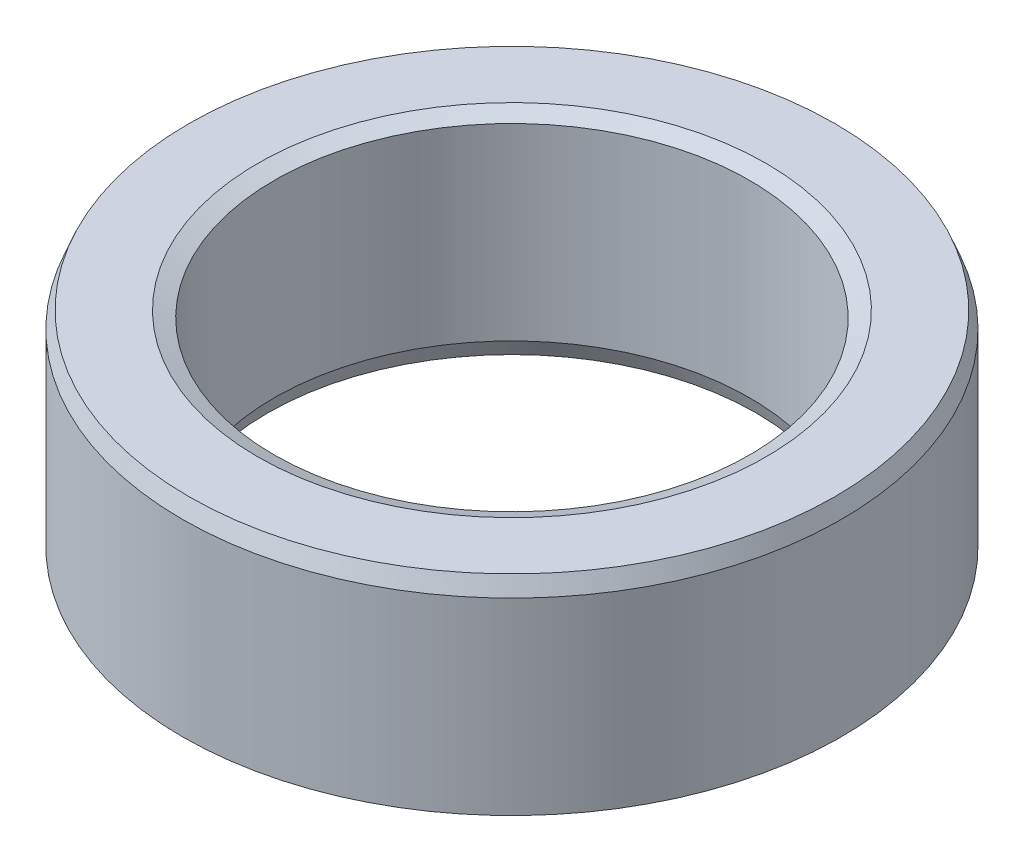
ISO-10303-21;
HEADER;
FILE_DESCRIPTION(('STEP AP214'),'2;1');
FILE_NAME('part.step','',(''),(''),'','','');
FILE_SCHEMA(('AUTOMOTIVE_DESIGN { 1 0 10303 214 1 1 1 1 }'));
ENDSEC;
DATA;
#1=APPLICATION_CONTEXT('core data for automotive mechanical design processes');
#2=APPLICATION_PROTOCOL_DEFINITION('international standard','automotive_design',2000,#1);
#3=PRODUCT_CONTEXT('',#1,'mechanical');
#4=PRODUCT('Part','Part','',(#3));
#5=PRODUCT_RELATED_PRODUCT_CATEGORY('part','',(#4));
#6=PRODUCT_DEFINITION_FORMATION('','',#4);
#7=PRODUCT_DEFINITION_CONTEXT('part definition',#1,'design');
#8=PRODUCT_DEFINITION('design','',#6,#7);
#9=PRODUCT_DEFINITION_SHAPE('','',#8);
#10=(LENGTH_UNIT() NAMED_UNIT(*) SI_UNIT(.MILLI.,.METRE.));
#11=(NAMED_UNIT(*) PLANE_ANGLE_UNIT() SI_UNIT($,.RADIAN.));
#12=(NAMED_UNIT(*) SI_UNIT($,.STERADIAN.) SOLID_ANGLE_UNIT());
#13=UNCERTAINTY_MEASURE_WITH_UNIT(LENGTH_MEASURE(1.E-05),#10,'distance_accuracy_value','');
#14=(GEOMETRIC_REPRESENTATION_CONTEXT(3) GLOBAL_UNCERTAINTY_ASSIGNED_CONTEXT((#13)) GLOBAL_UNIT_ASSIGNED_CONTEXT((#10,
#11,#12)) REPRESENTATION_CONTEXT('',''));
#15=CARTESIAN_POINT('',(0.,0.,0.));
#16=DIRECTION('',(0.,0.,1.));
#17=DIRECTION('',(1.,0.,0.));
#18=AXIS2_PLACEMENT_3D('',#15,#16,#17);
#19=CARTESIAN_POINT('',(0.,36.8528053937879,0.));
#20=DIRECTION('',(0.,-1.,0.));
#21=DIRECTION('',(0.,0.,-1.));
#22=AXIS2_PLACEMENT_3D('',#19,#20,#21);
#23=CYLINDRICAL_SURFACE('',#22,57.5);
#24=CARTESIAN_POINT('',(0.,1.13526865214583,0.));
#25=DIRECTION('',(0.,1.,0.));
#26=DIRECTION('',(0.,0.,1.));
#27=AXIS2_PLACEMENT_3D('',#24,#25,#26);
#28=CIRCLE('',#27,57.5);
#29=CARTESIAN_POINT('',(0.,1.13526865214583,57.5));
#30=VERTEX_POINT('',#29);
#31=EDGE_CURVE('E10',#30,#30,#28,.T.);
#32=ORIENTED_EDGE('',*,*,#31,.T.);
#33=EDGE_LOOP('',(#32));
#34=FACE_BOUND('',#33,.T.);
#35=CARTESIAN_POINT('',(0.,33.9882415762624,0.));
#36=DIRECTION('',(0.,1.,0.));
#37=DIRECTION('',(0.,0.,1.));
#38=AXIS2_PLACEMENT_3D('',#35,#36,#37);
#39=CIRCLE('',#38,57.5);
#40=CARTESIAN_POINT('',(0.,33.9882415762624,57.5));
#41=VERTEX_POINT('',#40);
#42=EDGE_CURVE('E50',#41,#41,#39,.F.);
#43=ORIENTED_EDGE('',*,*,#42,.T.);
#44=EDGE_LOOP('',(#43));
#45=FACE_BOUND('',#44,.T.);
#46=ADVANCED_FACE('F39',(#34,#45),#23,.T.);
#47=CARTESIAN_POINT('',(0.,36.8528053937879,0.));
#48=DIRECTION('',(0.,1.,0.));
#49=DIRECTION('',(0.,0.,1.));
#50=AXIS2_PLACEMENT_3D('',#47,#48,#49);
#51=PLANE('',#50);
#52=CARTESIAN_POINT('',(0.,36.8528053937879,0.));
#53=DIRECTION('',(0.,1.,0.));
#54=DIRECTION('',(0.,0.,1.));
#55=AXIS2_PLACEMENT_3D('',#52,#53,#54);
#56=CIRCLE('',#55,44.3482665605662);
#57=CARTESIAN_POINT('',(0.,36.8528053937879,44.3482665605662));
#58=VERTEX_POINT('',#57);
#59=EDGE_CURVE('E58',#58,#58,#56,.F.);
#60=ORIENTED_EDGE('',*,*,#59,.T.);
#61=EDGE_LOOP('',(#60));
#62=FACE_BOUND('',#61,.T.);
#63=CARTESIAN_POINT('',(0.,36.8528053937879,0.));
#64=DIRECTION('',(0.,1.,0.));
#65=DIRECTION('',(0.,0.,1.));
#66=AXIS2_PLACEMENT_3D('',#63,#64,#65);
#67=CIRCLE('',#66,56.3647313478541);
#68=CARTESIAN_POINT('',(0.,36.8528053937879,56.3647313478541));
#69=VERTEX_POINT('',#68);
#70=EDGE_CURVE('E61',#69,#69,#67,.T.);
#71=ORIENTED_EDGE('',*,*,#70,.T.);
#72=EDGE_LOOP('',(#71));
#73=FACE_BOUND('',#72,.T.);
#74=ADVANCED_FACE('F88',(#62,#73),#51,.T.);
#75=CARTESIAN_POINT('',(0.,0.,0.));
#76=DIRECTION('',(0.,1.,0.));
#77=DIRECTION('',(0.,0.,1.));
#78=AXIS2_PLACEMENT_3D('',#75,#76,#77);
#79=PLANE('',#78);
#80=CARTESIAN_POINT('',(0.,0.,0.));
#81=DIRECTION('',(0.,1.,0.));
#82=DIRECTION('',(0.,0.,1.));
#83=AXIS2_PLACEMENT_3D('',#80,#81,#82);
#84=CIRCLE('',#83,42.6189713951866);
#85=CARTESIAN_POINT('',(0.,0.,42.6189713951866));
#86=VERTEX_POINT('',#85);
#87=EDGE_CURVE('E51',#86,#86,#84,.T.);
#88=ORIENTED_EDGE('',*,*,#87,.T.);
#89=EDGE_LOOP('',(#88));
#90=FACE_BOUND('',#89,.T.);
#91=CARTESIAN_POINT('',(0.,0.,0.));
#92=DIRECTION('',(0.,1.,0.));
#93=DIRECTION('',(0.,0.,1.));
#94=AXIS2_PLACEMENT_3D('',#91,#92,#93);
#95=CIRCLE('',#94,54.6354361824746);
#96=CARTESIAN_POINT('',(0.,0.,54.6354361824746));
#97=VERTEX_POINT('',#96);
#98=EDGE_CURVE('E54',#97,#97,#95,.F.);
#99=ORIENTED_EDGE('',*,*,#98,.T.);
#100=EDGE_LOOP('',(#99));
#101=FACE_BOUND('',#100,.T.);
#102=ADVANCED_FACE('F83',(#90,#101),#79,.F.);
#103=CARTESIAN_POINT('',(0.,36.8528053937879,0.));
#104=DIRECTION('',(0.,-1.,0.));
#105=DIRECTION('',(0.,0.,-1.));
#106=AXIS2_PLACEMENT_3D('',#103,#104,#105);
#107=CYLINDRICAL_SURFACE('',#106,41.4837027430408);
#108=CARTESIAN_POINT('',(0.,35.7175367416421,0.));
#109=DIRECTION('',(0.,1.,0.));
#110=DIRECTION('',(0.,0.,1.));
#111=AXIS2_PLACEMENT_3D('',#108,#109,#110);
#112=CIRCLE('',#111,41.4837027430408);
#113=CARTESIAN_POINT('',(0.,35.7175367416421,41.4837027430408));
#114=VERTEX_POINT('',#113);
#115=EDGE_CURVE('E67',#114,#114,#112,.T.);
#116=ORIENTED_EDGE('',*,*,#115,.T.);
#117=EDGE_LOOP('',(#116));
#118=FACE_BOUND('',#117,.T.);
#119=CARTESIAN_POINT('',(0.,2.86456381752535,0.));
#120=DIRECTION('',(0.,1.,0.));
#121=DIRECTION('',(0.,0.,1.));
#122=AXIS2_PLACEMENT_3D('',#119,#120,#121);
#123=CIRCLE('',#122,41.4837027430408);
#124=CARTESIAN_POINT('',(0.,2.86456381752535,41.4837027430408));
#125=VERTEX_POINT('',#124);
#126=EDGE_CURVE('E69',#125,#125,#123,.F.);
#127=ORIENTED_EDGE('',*,*,#126,.T.);
#128=EDGE_LOOP('',(#127));
#129=FACE_BOUND('',#128,.T.);
#130=ADVANCED_FACE('F71',(#118,#129),#107,.F.);
#131=CARTESIAN_POINT('',(0.,35.7175367416421,0.));
#132=DIRECTION('',(0.,1.,0.));
#133=DIRECTION('',(0.,0.,1.));
#134=AXIS2_PLACEMENT_3D('',#131,#132,#133);
#135=CONICAL_SURFACE('',#134,41.4837027430408,1.19347099365172);
#136=ORIENTED_EDGE('',*,*,#59,.F.);
#137=EDGE_LOOP('',(#136));
#138=FACE_BOUND('',#137,.T.);
#139=ORIENTED_EDGE('',*,*,#115,.F.);
#140=EDGE_LOOP('',(#139));
#141=FACE_BOUND('',#140,.T.);
#142=ADVANCED_FACE('F77',(#138,#141),#135,.F.);
#143=CARTESIAN_POINT('',(0.,0.,0.));
#144=DIRECTION('',(0.,-1.,0.));
#145=DIRECTION('',(0.,0.,-1.));
#146=AXIS2_PLACEMENT_3D('',#143,#144,#145);
#147=CONICAL_SURFACE('',#146,42.6189713951866,0.37732533314318);
#148=ORIENTED_EDGE('',*,*,#126,.F.);
#149=EDGE_LOOP('',(#148));
#150=FACE_BOUND('',#149,.T.);
#151=ORIENTED_EDGE('',*,*,#87,.F.);
#152=EDGE_LOOP('',(#151));
#153=FACE_BOUND('',#152,.T.);
#154=ADVANCED_FACE('F73',(#150,#153),#147,.F.);
#155=CARTESIAN_POINT('',(0.,1.13526865214583,0.));
#156=DIRECTION('',(0.,1.,0.));
#157=DIRECTION('',(0.,0.,1.));
#158=AXIS2_PLACEMENT_3D('',#155,#156,#157);
#159=CONICAL_SURFACE('',#158,57.5,1.19347099365172);
#160=ORIENTED_EDGE('',*,*,#98,.F.);
#161=EDGE_LOOP('',(#160));
#162=FACE_BOUND('',#161,.T.);
#163=ORIENTED_EDGE('',*,*,#31,.F.);
#164=EDGE_LOOP('',(#163));
#165=FACE_BOUND('',#164,.T.);
#166=ADVANCED_FACE('F76',(#162,#165),#159,.T.);
#167=CARTESIAN_POINT('',(0.,36.8528053937879,0.));
#168=DIRECTION('',(0.,-1.,0.));
#169=DIRECTION('',(0.,0.,-1.));
#170=AXIS2_PLACEMENT_3D('',#167,#168,#169);
#171=CONICAL_SURFACE('',#170,56.3647313478541,0.377325333143182);
#172=ORIENTED_EDGE('',*,*,#42,.F.);
#173=EDGE_LOOP('',(#172));
#174=FACE_BOUND('',#173,.T.);
#175=ORIENTED_EDGE('',*,*,#70,.F.);
#176=EDGE_LOOP('',(#175));
#177=FACE_BOUND('',#176,.T.);
#178=ADVANCED_FACE('F45',(#174,#177),#171,.T.);
#179=CLOSED_SHELL('',(#46,#74,#102,#130,#142,#154,#166,#178));
#180=MANIFOLD_SOLID_BREP('B2',#179);
#181=ADVANCED_BREP_SHAPE_REPRESENTATION('',(#18,#180),#14);
#182=SHAPE_DEFINITION_REPRESENTATION(#9,#181);
ENDSEC;
END-ISO-10303-21;
